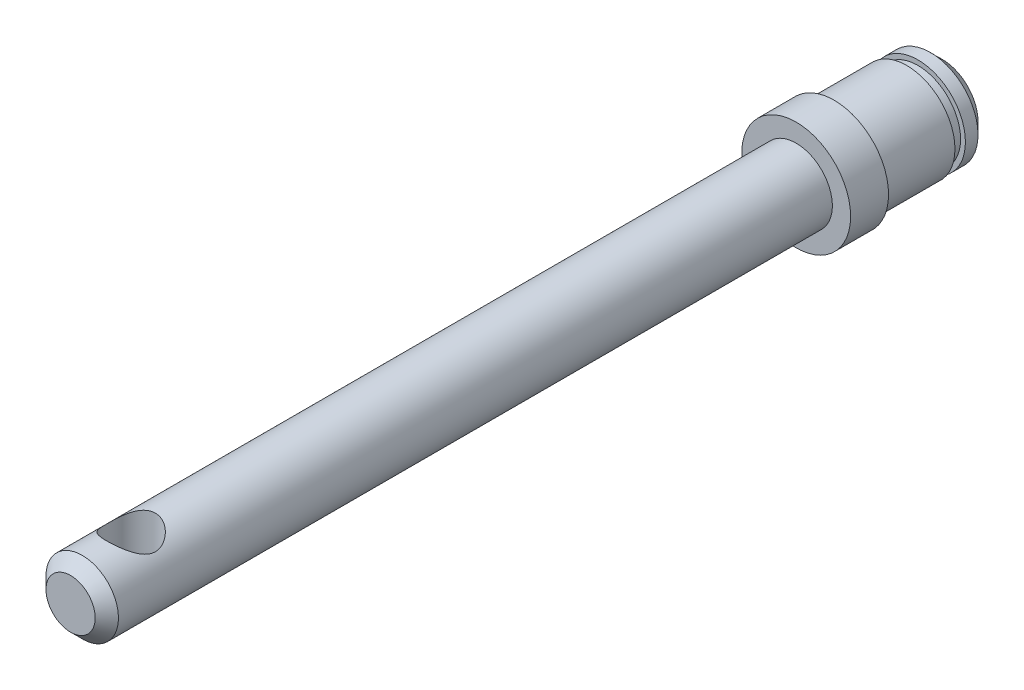
ISO-10303-21;
HEADER;
FILE_DESCRIPTION(('STEP AP214'),'2;1');
FILE_NAME('part.step','',(''),(''),'','','');
FILE_SCHEMA(('AUTOMOTIVE_DESIGN { 1 0 10303 214 1 1 1 1 }'));
ENDSEC;
DATA;
#1=APPLICATION_CONTEXT('core data for automotive mechanical design processes');
#2=APPLICATION_PROTOCOL_DEFINITION('international standard','automotive_design',2000,#1);
#3=PRODUCT_CONTEXT('',#1,'mechanical');
#4=PRODUCT('Part','Part','',(#3));
#5=PRODUCT_RELATED_PRODUCT_CATEGORY('part','',(#4));
#6=PRODUCT_DEFINITION_FORMATION('','',#4);
#7=PRODUCT_DEFINITION_CONTEXT('part definition',#1,'design');
#8=PRODUCT_DEFINITION('design','',#6,#7);
#9=PRODUCT_DEFINITION_SHAPE('','',#8);
#10=(LENGTH_UNIT() NAMED_UNIT(*) SI_UNIT(.MILLI.,.METRE.));
#11=(NAMED_UNIT(*) PLANE_ANGLE_UNIT() SI_UNIT($,.RADIAN.));
#12=(NAMED_UNIT(*) SI_UNIT($,.STERADIAN.) SOLID_ANGLE_UNIT());
#13=UNCERTAINTY_MEASURE_WITH_UNIT(LENGTH_MEASURE(1.E-05),#10,'distance_accuracy_value','');
#14=(GEOMETRIC_REPRESENTATION_CONTEXT(3) GLOBAL_UNCERTAINTY_ASSIGNED_CONTEXT((#13)) GLOBAL_UNIT_ASSIGNED_CONTEXT((#10,
#11,#12)) REPRESENTATION_CONTEXT('',''));
#15=CARTESIAN_POINT('',(0.,0.,0.));
#16=DIRECTION('',(0.,0.,1.));
#17=DIRECTION('',(1.,0.,0.));
#18=AXIS2_PLACEMENT_3D('',#15,#16,#17);
#19=CARTESIAN_POINT('',(0.,0.,-9.5758));
#20=DIRECTION('',(0.,0.,-1.));
#21=DIRECTION('',(-1.,0.,0.));
#22=AXIS2_PLACEMENT_3D('',#19,#20,#21);
#23=PLANE('',#22);
#24=CARTESIAN_POINT('',(0.,0.,-9.57579999993641));
#25=DIRECTION('',(0.,0.,1.));
#26=DIRECTION('',(1.,0.,0.));
#27=AXIS2_PLACEMENT_3D('',#24,#25,#26);
#28=CIRCLE('',#27,2.3494999999798);
#29=CARTESIAN_POINT('',(2.3494999999798,0.,-9.57579999993641));
#30=VERTEX_POINT('',#29);
#31=EDGE_CURVE('E19',#30,#30,#28,.T.);
#32=ORIENTED_EDGE('',*,*,#31,.F.);
#33=EDGE_LOOP('',(#32));
#34=FACE_BOUND('',#33,.T.);
#35=ADVANCED_FACE('F16',(#34),#23,.T.);
#36=CARTESIAN_POINT('',(0.,0.,-8.81380000009813));
#37=DIRECTION('',(0.,0.,1.));
#38=DIRECTION('',(1.,0.,0.));
#39=AXIS2_PLACEMENT_3D('',#36,#37,#38);
#40=CONICAL_SURFACE('',#39,3.11149999987492,0.785398163434747);
#41=ORIENTED_EDGE('',*,*,#31,.T.);
#42=EDGE_LOOP('',(#41));
#43=FACE_BOUND('',#42,.T.);
#44=CARTESIAN_POINT('',(0.,0.,-8.8138));
#45=DIRECTION('',(0.,0.,1.));
#46=DIRECTION('',(1.,0.,0.));
#47=AXIS2_PLACEMENT_3D('',#44,#45,#46);
#48=CIRCLE('',#47,3.1115);
#49=CARTESIAN_POINT('',(3.1115,0.,-8.8138));
#50=VERTEX_POINT('',#49);
#51=EDGE_CURVE('E35',#50,#50,#48,.T.);
#52=ORIENTED_EDGE('',*,*,#51,.F.);
#53=EDGE_LOOP('',(#52));
#54=FACE_BOUND('',#53,.T.);
#55=ADVANCED_FACE('F81',(#43,#54),#40,.T.);
#56=CARTESIAN_POINT('',(0.,0.,-9.5758));
#57=DIRECTION('',(0.,0.,1.));
#58=DIRECTION('',(1.,0.,0.));
#59=AXIS2_PLACEMENT_3D('',#56,#57,#58);
#60=CYLINDRICAL_SURFACE('',#59,3.1115);
#61=ORIENTED_EDGE('',*,*,#51,.T.);
#62=EDGE_LOOP('',(#61));
#63=FACE_BOUND('',#62,.T.);
#64=CARTESIAN_POINT('',(0.,0.,-7.9883));
#65=DIRECTION('',(0.,0.,1.));
#66=DIRECTION('',(1.,0.,0.));
#67=AXIS2_PLACEMENT_3D('',#64,#65,#66);
#68=CIRCLE('',#67,3.1115);
#69=CARTESIAN_POINT('',(3.1115,0.,-7.9883));
#70=VERTEX_POINT('',#69);
#71=EDGE_CURVE('E71',#70,#70,#68,.F.);
#72=ORIENTED_EDGE('',*,*,#71,.T.);
#73=EDGE_LOOP('',(#72));
#74=FACE_BOUND('',#73,.T.);
#75=ADVANCED_FACE('F88',(#63,#74),#60,.T.);
#76=CARTESIAN_POINT('',(0.,0.,-7.9883));
#77=DIRECTION('',(0.,0.,-1.));
#78=DIRECTION('',(-1.,0.,0.));
#79=AXIS2_PLACEMENT_3D('',#76,#77,#78);
#80=PLANE('',#79);
#81=CARTESIAN_POINT('',(0.,0.,-7.9883));
#82=DIRECTION('',(0.,0.,1.));
#83=DIRECTION('',(1.,0.,0.));
#84=AXIS2_PLACEMENT_3D('',#81,#82,#83);
#85=CIRCLE('',#84,2.794);
#86=CARTESIAN_POINT('',(2.794,0.,-7.9883));
#87=VERTEX_POINT('',#86);
#88=EDGE_CURVE('E69',#87,#87,#85,.T.);
#89=ORIENTED_EDGE('',*,*,#88,.F.);
#90=EDGE_LOOP('',(#89));
#91=FACE_BOUND('',#90,.T.);
#92=ORIENTED_EDGE('',*,*,#71,.F.);
#93=EDGE_LOOP('',(#92));
#94=FACE_BOUND('',#93,.T.);
#95=ADVANCED_FACE('F92',(#91,#94),#80,.F.);
#96=CARTESIAN_POINT('',(0.,0.,-7.9883));
#97=DIRECTION('',(0.,0.,1.));
#98=DIRECTION('',(1.,0.,0.));
#99=AXIS2_PLACEMENT_3D('',#96,#97,#98);
#100=CYLINDRICAL_SURFACE('',#99,2.794);
#101=CARTESIAN_POINT('',(0.,0.,-7.2517));
#102=DIRECTION('',(0.,0.,1.));
#103=DIRECTION('',(1.,0.,0.));
#104=AXIS2_PLACEMENT_3D('',#101,#102,#103);
#105=CIRCLE('',#104,2.794);
#106=CARTESIAN_POINT('',(2.794,0.,-7.2517));
#107=VERTEX_POINT('',#106);
#108=EDGE_CURVE('E66',#107,#107,#105,.T.);
#109=ORIENTED_EDGE('',*,*,#108,.F.);
#110=EDGE_LOOP('',(#109));
#111=FACE_BOUND('',#110,.T.);
#112=ORIENTED_EDGE('',*,*,#88,.T.);
#113=EDGE_LOOP('',(#112));
#114=FACE_BOUND('',#113,.T.);
#115=ADVANCED_FACE('F97',(#111,#114),#100,.T.);
#116=CARTESIAN_POINT('',(0.,0.,-7.2517));
#117=DIRECTION('',(0.,0.,-1.));
#118=DIRECTION('',(-1.,0.,0.));
#119=AXIS2_PLACEMENT_3D('',#116,#117,#118);
#120=PLANE('',#119);
#121=ORIENTED_EDGE('',*,*,#108,.T.);
#122=EDGE_LOOP('',(#121));
#123=FACE_BOUND('',#122,.T.);
#124=CARTESIAN_POINT('',(0.,0.,-7.2517));
#125=DIRECTION('',(0.,0.,1.));
#126=DIRECTION('',(1.,0.,0.));
#127=AXIS2_PLACEMENT_3D('',#124,#125,#126);
#128=CIRCLE('',#127,3.1623);
#129=CARTESIAN_POINT('',(3.1623,0.,-7.2517));
#130=VERTEX_POINT('',#129);
#131=EDGE_CURVE('E63',#130,#130,#128,.T.);
#132=ORIENTED_EDGE('',*,*,#131,.F.);
#133=EDGE_LOOP('',(#132));
#134=FACE_BOUND('',#133,.T.);
#135=ADVANCED_FACE('F101',(#123,#134),#120,.T.);
#136=CARTESIAN_POINT('',(0.,0.,-7.2517));
#137=DIRECTION('',(0.,0.,1.));
#138=DIRECTION('',(1.,0.,0.));
#139=AXIS2_PLACEMENT_3D('',#136,#137,#138);
#140=CYLINDRICAL_SURFACE('',#139,3.1623);
#141=ORIENTED_EDGE('',*,*,#131,.T.);
#142=EDGE_LOOP('',(#141));
#143=FACE_BOUND('',#142,.T.);
#144=CARTESIAN_POINT('',(0.,0.,-2.4892));
#145=DIRECTION('',(0.,0.,1.));
#146=DIRECTION('',(1.,0.,0.));
#147=AXIS2_PLACEMENT_3D('',#144,#145,#146);
#148=CIRCLE('',#147,3.1623);
#149=CARTESIAN_POINT('',(3.1623,0.,-2.4892));
#150=VERTEX_POINT('',#149);
#151=EDGE_CURVE('E60',#150,#150,#148,.F.);
#152=ORIENTED_EDGE('',*,*,#151,.T.);
#153=EDGE_LOOP('',(#152));
#154=FACE_BOUND('',#153,.T.);
#155=ADVANCED_FACE('F105',(#143,#154),#140,.T.);
#156=CARTESIAN_POINT('',(0.,0.,-2.4892));
#157=DIRECTION('',(0.,0.,1.));
#158=DIRECTION('',(1.,0.,0.));
#159=AXIS2_PLACEMENT_3D('',#156,#157,#158);
#160=PLANE('',#159);
#161=ORIENTED_EDGE('',*,*,#151,.F.);
#162=EDGE_LOOP('',(#161));
#163=FACE_BOUND('',#162,.T.);
#164=CARTESIAN_POINT('',(0.,0.,-2.4892));
#165=DIRECTION('',(0.,0.,1.));
#166=DIRECTION('',(1.,0.,0.));
#167=AXIS2_PLACEMENT_3D('',#164,#165,#166);
#168=CIRCLE('',#167,3.571875);
#169=CARTESIAN_POINT('',(3.571875,0.,-2.4892));
#170=VERTEX_POINT('',#169);
#171=EDGE_CURVE('E57',#170,#170,#168,.T.);
#172=ORIENTED_EDGE('',*,*,#171,.F.);
#173=EDGE_LOOP('',(#172));
#174=FACE_BOUND('',#173,.T.);
#175=ADVANCED_FACE('F109',(#163,#174),#160,.F.);
#176=CARTESIAN_POINT('',(0.,0.,47.5742));
#177=DIRECTION('',(0.,0.,1.));
#178=DIRECTION('',(1.,0.,0.));
#179=AXIS2_PLACEMENT_3D('',#176,#177,#178);
#180=PLANE('',#179);
#181=CARTESIAN_POINT('',(0.,0.,47.5741999999855));
#182=DIRECTION('',(0.,0.,-1.));
#183=DIRECTION('',(-1.,0.,0.));
#184=AXIS2_PLACEMENT_3D('',#181,#182,#183);
#185=CIRCLE('',#184,1.61289999999781);
#186=CARTESIAN_POINT('',(-1.61289999999781,0.,47.5741999999855));
#187=VERTEX_POINT('',#186);
#188=EDGE_CURVE('E54',#187,#187,#185,.T.);
#189=ORIENTED_EDGE('',*,*,#188,.F.);
#190=EDGE_LOOP('',(#189));
#191=FACE_BOUND('',#190,.T.);
#192=ADVANCED_FACE('F113',(#191),#180,.T.);
#193=CARTESIAN_POINT('',(0.,0.,-2.4892));
#194=DIRECTION('',(0.,0.,1.));
#195=DIRECTION('',(1.,0.,0.));
#196=AXIS2_PLACEMENT_3D('',#193,#194,#195);
#197=CYLINDRICAL_SURFACE('',#196,3.571875);
#198=ORIENTED_EDGE('',*,*,#171,.T.);
#199=EDGE_LOOP('',(#198));
#200=FACE_BOUND('',#199,.T.);
#201=CARTESIAN_POINT('',(0.,0.,0.));
#202=DIRECTION('',(0.,0.,1.));
#203=DIRECTION('',(1.,0.,0.));
#204=AXIS2_PLACEMENT_3D('',#201,#202,#203);
#205=CIRCLE('',#204,3.571875);
#206=CARTESIAN_POINT('',(3.571875,0.,0.));
#207=VERTEX_POINT('',#206);
#208=EDGE_CURVE('E51',#207,#207,#205,.T.);
#209=ORIENTED_EDGE('',*,*,#208,.F.);
#210=EDGE_LOOP('',(#209));
#211=FACE_BOUND('',#210,.T.);
#212=ADVANCED_FACE('F117',(#200,#211),#197,.T.);
#213=CARTESIAN_POINT('',(0.,0.,46.8121999999767));
#214=DIRECTION('',(0.,0.,-1.));
#215=DIRECTION('',(-1.,0.,0.));
#216=AXIS2_PLACEMENT_3D('',#213,#214,#215);
#217=CONICAL_SURFACE('',#216,2.37490000000662,0.785398163397448);
#218=ORIENTED_EDGE('',*,*,#188,.T.);
#219=EDGE_LOOP('',(#218));
#220=FACE_BOUND('',#219,.T.);
#221=CARTESIAN_POINT('',(0.,0.,46.8122));
#222=DIRECTION('',(0.,0.,-1.));
#223=DIRECTION('',(-1.,0.,0.));
#224=AXIS2_PLACEMENT_3D('',#221,#222,#223);
#225=CIRCLE('',#224,2.3749);
#226=CARTESIAN_POINT('',(-2.3749,0.,46.8122));
#227=VERTEX_POINT('',#226);
#228=EDGE_CURVE('E28',#227,#227,#225,.T.);
#229=ORIENTED_EDGE('',*,*,#228,.F.);
#230=EDGE_LOOP('',(#229));
#231=FACE_BOUND('',#230,.T.);
#232=ADVANCED_FACE('F121',(#220,#231),#217,.T.);
#233=CARTESIAN_POINT('',(0.,0.,0.));
#234=DIRECTION('',(0.,0.,1.));
#235=DIRECTION('',(1.,0.,0.));
#236=AXIS2_PLACEMENT_3D('',#233,#234,#235);
#237=PLANE('',#236);
#238=CARTESIAN_POINT('',(0.,0.,0.));
#239=DIRECTION('',(0.,0.,-1.));
#240=DIRECTION('',(-1.,0.,0.));
#241=AXIS2_PLACEMENT_3D('',#238,#239,#240);
#242=CIRCLE('',#241,2.3749);
#243=CARTESIAN_POINT('',(-2.3749,0.,0.));
#244=VERTEX_POINT('',#243);
#245=EDGE_CURVE('E23',#244,#244,#242,.F.);
#246=ORIENTED_EDGE('',*,*,#245,.F.);
#247=EDGE_LOOP('',(#246));
#248=FACE_BOUND('',#247,.T.);
#249=ORIENTED_EDGE('',*,*,#208,.T.);
#250=EDGE_LOOP('',(#249));
#251=FACE_BOUND('',#250,.T.);
#252=ADVANCED_FACE('F124',(#248,#251),#237,.T.);
#253=CARTESIAN_POINT('',(0.,-3.571875,43.60545));
#254=DIRECTION('',(0.,1.,0.));
#255=DIRECTION('',(0.,0.,1.));
#256=AXIS2_PLACEMENT_3D('',#253,#254,#255);
#257=CYLINDRICAL_SURFACE('',#256,1.5875);
#258=CARTESIAN_POINT('',(0.,2.3749,45.19295));
#259=CARTESIAN_POINT('',(-0.0796285021727966,2.37489427166207,45.1929439134093));
#260=CARTESIAN_POINT('',(-0.159333187346092,2.3708547437601,45.1869178453679));
#261=CARTESIAN_POINT('',(-0.316246788253907,2.35507625489168,45.1631617849446));
#262=CARTESIAN_POINT('',(-0.393451638249593,2.34332535323937,45.1454136412255));
#263=CARTESIAN_POINT('',(-0.542790518515763,2.31328830758023,45.0993083312295));
#264=CARTESIAN_POINT('',(-0.614948378456795,2.29503576257873,45.0710056736267));
#265=CARTESIAN_POINT('',(-0.753178545236462,2.25346165524091,45.0050040485006));
#266=CARTESIAN_POINT('',(-0.819251194999285,2.23014037879558,44.9673056109087));
#267=CARTESIAN_POINT('',(-0.949807131451189,2.17792784028168,44.8800881288627));
#268=CARTESIAN_POINT('',(-1.01367601133952,2.14873138397025,44.8298358883516));
#269=CARTESIAN_POINT('',(-1.13266066753279,2.0884656766868,44.7206931180195));
#270=CARTESIAN_POINT('',(-1.18776336726205,2.05739372150985,44.6617899306125));
#271=CARTESIAN_POINT('',(-1.29659427145063,1.99089626995362,44.5261680967343));
#272=CARTESIAN_POINT('',(-1.34871636553572,1.95556248733199,44.4481056626616));
#273=CARTESIAN_POINT('',(-1.43904349853149,1.89008374794265,44.2823403381314));
#274=CARTESIAN_POINT('',(-1.4772725865024,1.85992987284409,44.1946544520516));
#275=CARTESIAN_POINT('',(-1.52904517834333,1.81740283377534,44.0377472795276));
#276=CARTESIAN_POINT('',(-1.54653236351236,1.80240921282223,43.9705447171603));
#277=CARTESIAN_POINT('',(-1.57261168441343,1.77970474695812,43.8332848433952));
#278=CARTESIAN_POINT('',(-1.58121930044462,1.7719812296935,43.763232722255));
#279=CARTESIAN_POINT('',(-1.58899802612375,1.76501215254764,43.6218716388384));
#280=CARTESIAN_POINT('',(-1.58812985724121,1.76580188116326,43.5505586693621));
#281=CARTESIAN_POINT('',(-1.57692650593038,1.77581049841768,43.4092572197684));
#282=CARTESIAN_POINT('',(-1.56658327442516,1.7850365537139,43.3392699174096));
#283=CARTESIAN_POINT('',(-1.53778680769931,1.80988877384798,43.2056567626746));
#284=CARTESIAN_POINT('',(-1.51972103829905,1.82520699487101,43.1418863605764));
#285=CARTESIAN_POINT('',(-1.47635800673587,1.86045582345457,43.0182351850859));
#286=CARTESIAN_POINT('',(-1.45105836975688,1.88038794530891,42.9583556969829));
#287=CARTESIAN_POINT('',(-1.38804369169894,1.92751840139636,42.8311724358925));
#288=CARTESIAN_POINT('',(-1.34884877883874,1.95536954816995,42.7648460457442));
#289=CARTESIAN_POINT('',(-1.26169992826936,2.01270750683002,42.6389401049234));
#290=CARTESIAN_POINT('',(-1.21373539144903,2.04219626760565,42.5793688613398));
#291=CARTESIAN_POINT('',(-1.09822042057742,2.10697571698643,42.4553504562286));
#292=CARTESIAN_POINT('',(-1.02867941502371,2.14213147691545,42.3926663982129));
#293=CARTESIAN_POINT('',(-0.87829590652397,2.20804612806214,42.2797162875604));
#294=CARTESIAN_POINT('',(-0.797461070213304,2.23880797360637,42.2294418743602));
#295=CARTESIAN_POINT('',(-0.642794196366182,2.28740091649053,42.151857840345));
#296=CARTESIAN_POINT('',(-0.570673934887535,2.30658392602361,42.1219812810788));
#297=CARTESIAN_POINT('',(-0.421590346714549,2.33841465201831,42.0729550712348));
#298=CARTESIAN_POINT('',(-0.344638477425361,2.35107721947041,42.05378103609));
#299=CARTESIAN_POINT('',(-0.222529004084351,2.36486476954346,42.0329936390966));
#300=CARTESIAN_POINT('',(-0.178308116016056,2.36861511899109,42.0273651451537));
#301=CARTESIAN_POINT('',(-0.0893995612791168,2.37363462559172,42.0198411908061));
#302=CARTESIAN_POINT('',(-0.0447117904210668,2.37490321648955,42.0179465823498));
#303=CARTESIAN_POINT('',(0.0796285021727959,2.37489427166207,42.0179560865907));
#304=CARTESIAN_POINT('',(0.159333187346092,2.3708547437601,42.0239821546321));
#305=CARTESIAN_POINT('',(0.316246788253906,2.35507625489168,42.0477382150553));
#306=CARTESIAN_POINT('',(0.393451638249593,2.34332535323937,42.0654863587745));
#307=CARTESIAN_POINT('',(0.542790518515763,2.31328830758023,42.1115916687705));
#308=CARTESIAN_POINT('',(0.614948378456795,2.29503576257873,42.1398943263733));
#309=CARTESIAN_POINT('',(0.753178545236463,2.25346165524091,42.2058959514994));
#310=CARTESIAN_POINT('',(0.819251194999285,2.23014037879558,42.2435943890913));
#311=CARTESIAN_POINT('',(0.949807131451189,2.17792784028168,42.3308118711373));
#312=CARTESIAN_POINT('',(1.01367601133952,2.14873138397025,42.3810641116484));
#313=CARTESIAN_POINT('',(1.13266066753279,2.0884656766868,42.4902068819805));
#314=CARTESIAN_POINT('',(1.18776336726205,2.05739372150985,42.5491100693874));
#315=CARTESIAN_POINT('',(1.29659427145063,1.99089626995362,42.6847319032657));
#316=CARTESIAN_POINT('',(1.34871636553572,1.95556248733199,42.7627943373384));
#317=CARTESIAN_POINT('',(1.43904349853149,1.89008374794265,42.9285596618686));
#318=CARTESIAN_POINT('',(1.4772725865024,1.85992987284409,43.0162455479484));
#319=CARTESIAN_POINT('',(1.52904517834333,1.81740283377534,43.1731527204724));
#320=CARTESIAN_POINT('',(1.54653236351236,1.80240921282223,43.2403552828397));
#321=CARTESIAN_POINT('',(1.57261168441343,1.77970474695812,43.3776151566048));
#322=CARTESIAN_POINT('',(1.58121930044462,1.7719812296935,43.447667277745));
#323=CARTESIAN_POINT('',(1.58899802612375,1.76501215254764,43.5890283611616));
#324=CARTESIAN_POINT('',(1.58812985724121,1.76580188116326,43.6603413306379));
#325=CARTESIAN_POINT('',(1.57692650593038,1.77581049841768,43.8016427802316));
#326=CARTESIAN_POINT('',(1.56658327442517,1.7850365537139,43.8716300825904));
#327=CARTESIAN_POINT('',(1.53778680769931,1.80988877384798,44.0052432373254));
#328=CARTESIAN_POINT('',(1.51972103829905,1.825206994871,44.0690136394236));
#329=CARTESIAN_POINT('',(1.47635800673587,1.86045582345457,44.192664814914));
#330=CARTESIAN_POINT('',(1.45105836975689,1.88038794530891,44.2525443030171));
#331=CARTESIAN_POINT('',(1.38804369169894,1.92751840139636,44.3797275641075));
#332=CARTESIAN_POINT('',(1.34884877883874,1.95536954816995,44.4460539542558));
#333=CARTESIAN_POINT('',(1.26169992826936,2.01270750683002,44.5719598950766));
#334=CARTESIAN_POINT('',(1.21373539144903,2.04219626760564,44.6315311386602));
#335=CARTESIAN_POINT('',(1.09822042057742,2.10697571698643,44.7555495437714));
#336=CARTESIAN_POINT('',(1.02867941502371,2.14213147691544,44.8182336017871));
#337=CARTESIAN_POINT('',(0.87829590652398,2.20804612806214,44.9311837124396));
#338=CARTESIAN_POINT('',(0.797461070213316,2.23880797360636,44.9814581256398));
#339=CARTESIAN_POINT('',(0.642794196366197,2.28740091649053,45.059042159655));
#340=CARTESIAN_POINT('',(0.57067393488755,2.30658392602361,45.0889187189212));
#341=CARTESIAN_POINT('',(0.421590346714565,2.33841465201831,45.1379449287651));
#342=CARTESIAN_POINT('',(0.344638477425378,2.3510772194704,45.15711896391));
#343=CARTESIAN_POINT('',(0.222529004084365,2.36486476954346,45.1779063609034));
#344=CARTESIAN_POINT('',(0.178308116016067,2.36861511899109,45.1835348548463));
#345=CARTESIAN_POINT('',(0.0893995612791212,2.37363462559172,45.1910588091939));
#346=CARTESIAN_POINT('',(0.0447117904210687,2.37490321648955,45.1929534176502));
#347=CARTESIAN_POINT('',(0.,2.3749,45.19295));
#348=B_SPLINE_CURVE_WITH_KNOTS('',3,(#258,#259,#260,#261,#262,#263,#264,#265,#266,#267,#268,
#269,#270,#271,#272,#273,#274,#275,#276,#277,#278,#279,#280,#281,#282,#283,#284,#285,#286,#287,
#288,#289,#290,#291,#292,#293,#294,#295,#296,#297,#298,#299,#300,#301,#302,#303,#304,#305,#306,
#307,#308,#309,#310,#311,#312,#313,#314,#315,#316,#317,#318,#319,#320,#321,#322,#323,#324,#325,
#326,#327,#328,#329,#330,#331,#332,#333,#334,#335,#336,#337,#338,#339,#340,#341,#342,#343,#344,
#345,#346,#347),.UNSPECIFIED.,.T.,.F.,(4,2,2,2,2,2,2,2,2,2,2,2,2,2,2,2,2,2,2,2,2,2,2,2,2,2,2,2,
2,2,2,2,2,2,2,2,2,2,2,2,2,2,2,2,4),(0.,0.238700395852421,0.477771282535445,0.71562421428543,
0.95346373392742,1.21155549797826,1.47002872073382,1.76952408912618,2.06849852769238,
2.28077891750231,2.49268859719911,2.70547700634111,2.9184463472867,3.12179507761272,
3.32521064236503,3.57012288877609,3.815333120713,4.1139409115089,4.41234697329097,
4.65252034508975,4.89214425005817,5.02614510978654,5.16017654051243,5.39887693636485,
5.63794782304788,5.87580075479786,6.11364027443985,6.37173203849069,6.63020526124625,
6.92970062963861,7.22867506820481,7.44095545801474,7.65286513771153,7.86565354685354,
8.07862288779913,8.28197161812515,8.48538718287745,8.73029942928851,8.97550966122542,
9.27411745202132,9.57252351380338,9.81269688560216,10.0523207905706,10.186321650299,
10.3203530810249),.UNSPECIFIED.);
#349=CARTESIAN_POINT('',(0.,2.3749,45.19295));
#350=VERTEX_POINT('',#349);
#351=EDGE_CURVE('E46',#350,#350,#348,.T.);
#352=ORIENTED_EDGE('',*,*,#351,.F.);
#353=EDGE_LOOP('',(#352));
#354=FACE_BOUND('',#353,.T.);
#355=CARTESIAN_POINT('',(0.,-2.3749,45.19295));
#356=CARTESIAN_POINT('',(0.079628502172797,-2.37489427166208,45.1929439134093));
#357=CARTESIAN_POINT('',(0.159333187346093,-2.3708547437601,45.1869178453679));
#358=CARTESIAN_POINT('',(0.316246788253907,-2.35507625489168,45.1631617849446));
#359=CARTESIAN_POINT('',(0.393451638249594,-2.34332535323937,45.1454136412255));
#360=CARTESIAN_POINT('',(0.542790518515763,-2.31328830758023,45.0993083312295));
#361=CARTESIAN_POINT('',(0.614948378456796,-2.29503576257873,45.0710056736267));
#362=CARTESIAN_POINT('',(0.753178545236462,-2.25346165524091,45.0050040485006));
#363=CARTESIAN_POINT('',(0.819251194999285,-2.23014037879558,44.9673056109087));
#364=CARTESIAN_POINT('',(0.949807131451189,-2.17792784028168,44.8800881288627));
#365=CARTESIAN_POINT('',(1.01367601133952,-2.14873138397025,44.8298358883516));
#366=CARTESIAN_POINT('',(1.13266066753279,-2.0884656766868,44.7206931180195));
#367=CARTESIAN_POINT('',(1.18776336726205,-2.05739372150985,44.6617899306125));
#368=CARTESIAN_POINT('',(1.29659427145063,-1.99089626995362,44.5261680967343));
#369=CARTESIAN_POINT('',(1.34871636553572,-1.95556248733199,44.4481056626616));
#370=CARTESIAN_POINT('',(1.43904349853149,-1.89008374794265,44.2823403381314));
#371=CARTESIAN_POINT('',(1.4772725865024,-1.85992987284409,44.1946544520516));
#372=CARTESIAN_POINT('',(1.52904517834333,-1.81740283377534,44.0377472795276));
#373=CARTESIAN_POINT('',(1.54653236351237,-1.80240921282223,43.9705447171602));
#374=CARTESIAN_POINT('',(1.57261168441344,-1.77970474695812,43.8332848433952));
#375=CARTESIAN_POINT('',(1.58121930044462,-1.7719812296935,43.763232722255));
#376=CARTESIAN_POINT('',(1.58899802612375,-1.76501215254764,43.6218716388384));
#377=CARTESIAN_POINT('',(1.58812985724121,-1.76580188116326,43.5505586693621));
#378=CARTESIAN_POINT('',(1.57692650593038,-1.77581049841768,43.4092572197684));
#379=CARTESIAN_POINT('',(1.56658327442516,-1.7850365537139,43.3392699174096));
#380=CARTESIAN_POINT('',(1.53778680769931,-1.80988877384798,43.2056567626746));
#381=CARTESIAN_POINT('',(1.51972103829905,-1.82520699487101,43.1418863605764));
#382=CARTESIAN_POINT('',(1.47635800673587,-1.86045582345457,43.0182351850859));
#383=CARTESIAN_POINT('',(1.45105836975688,-1.88038794530891,42.9583556969829));
#384=CARTESIAN_POINT('',(1.38804369169894,-1.92751840139636,42.8311724358925));
#385=CARTESIAN_POINT('',(1.34884877883874,-1.95536954816995,42.7648460457442));
#386=CARTESIAN_POINT('',(1.26169992826936,-2.01270750683002,42.6389401049234));
#387=CARTESIAN_POINT('',(1.21373539144903,-2.04219626760565,42.5793688613398));
#388=CARTESIAN_POINT('',(1.09822042057742,-2.10697571698643,42.4553504562286));
#389=CARTESIAN_POINT('',(1.0286794150237,-2.14213147691545,42.3926663982129));
#390=CARTESIAN_POINT('',(0.878295906523966,-2.20804612806214,42.2797162875604));
#391=CARTESIAN_POINT('',(0.797461070213302,-2.23880797360637,42.2294418743602));
#392=CARTESIAN_POINT('',(0.642794196366183,-2.28740091649053,42.151857840345));
#393=CARTESIAN_POINT('',(0.570673934887537,-2.30658392602361,42.1219812810788));
#394=CARTESIAN_POINT('',(0.421590346714551,-2.33841465201831,42.0729550712348));
#395=CARTESIAN_POINT('',(0.344638477425362,-2.35107721947041,42.05378103609));
#396=CARTESIAN_POINT('',(0.22252900408435,-2.36486476954346,42.0329936390966));
#397=CARTESIAN_POINT('',(0.178308116016056,-2.36861511899109,42.0273651451537));
#398=CARTESIAN_POINT('',(0.0893995612791169,-2.37363462559172,42.0198411908061));
#399=CARTESIAN_POINT('',(0.0447117904210671,-2.37490321648955,42.0179465823498));
#400=CARTESIAN_POINT('',(-0.0796285021727957,-2.37489427166208,42.0179560865907));
#401=CARTESIAN_POINT('',(-0.159333187346092,-2.3708547437601,42.0239821546321));
#402=CARTESIAN_POINT('',(-0.316246788253906,-2.35507625489168,42.0477382150553));
#403=CARTESIAN_POINT('',(-0.393451638249593,-2.34332535323937,42.0654863587745));
#404=CARTESIAN_POINT('',(-0.542790518515762,-2.31328830758023,42.1115916687705));
#405=CARTESIAN_POINT('',(-0.614948378456795,-2.29503576257873,42.1398943263733));
#406=CARTESIAN_POINT('',(-0.753178545236462,-2.25346165524091,42.2058959514994));
#407=CARTESIAN_POINT('',(-0.819251194999284,-2.23014037879558,42.2435943890913));
#408=CARTESIAN_POINT('',(-0.949807131451189,-2.17792784028168,42.3308118711373));
#409=CARTESIAN_POINT('',(-1.01367601133952,-2.14873138397025,42.3810641116484));
#410=CARTESIAN_POINT('',(-1.13266066753279,-2.0884656766868,42.4902068819805));
#411=CARTESIAN_POINT('',(-1.18776336726205,-2.05739372150985,42.5491100693874));
#412=CARTESIAN_POINT('',(-1.29659427145063,-1.99089626995362,42.6847319032657));
#413=CARTESIAN_POINT('',(-1.34871636553572,-1.95556248733199,42.7627943373384));
#414=CARTESIAN_POINT('',(-1.43904349853149,-1.89008374794265,42.9285596618686));
#415=CARTESIAN_POINT('',(-1.4772725865024,-1.85992987284409,43.0162455479484));
#416=CARTESIAN_POINT('',(-1.52904517834333,-1.81740283377534,43.1731527204724));
#417=CARTESIAN_POINT('',(-1.54653236351237,-1.80240921282223,43.2403552828398));
#418=CARTESIAN_POINT('',(-1.57261168441344,-1.77970474695812,43.3776151566048));
#419=CARTESIAN_POINT('',(-1.58121930044462,-1.7719812296935,43.447667277745));
#420=CARTESIAN_POINT('',(-1.58899802612375,-1.76501215254764,43.5890283611616));
#421=CARTESIAN_POINT('',(-1.58812985724121,-1.76580188116326,43.6603413306379));
#422=CARTESIAN_POINT('',(-1.57692650593038,-1.77581049841768,43.8016427802316));
#423=CARTESIAN_POINT('',(-1.56658327442516,-1.7850365537139,43.8716300825904));
#424=CARTESIAN_POINT('',(-1.53778680769931,-1.80988877384798,44.0052432373254));
#425=CARTESIAN_POINT('',(-1.51972103829905,-1.82520699487101,44.0690136394236));
#426=CARTESIAN_POINT('',(-1.47635800673587,-1.86045582345457,44.192664814914));
#427=CARTESIAN_POINT('',(-1.45105836975688,-1.88038794530891,44.2525443030171));
#428=CARTESIAN_POINT('',(-1.38804369169894,-1.92751840139636,44.3797275641075));
#429=CARTESIAN_POINT('',(-1.34884877883874,-1.95536954816995,44.4460539542558));
#430=CARTESIAN_POINT('',(-1.26169992826936,-2.01270750683002,44.5719598950766));
#431=CARTESIAN_POINT('',(-1.21373539144903,-2.04219626760565,44.6315311386602));
#432=CARTESIAN_POINT('',(-1.09822042057742,-2.10697571698643,44.7555495437714));
#433=CARTESIAN_POINT('',(-1.02867941502371,-2.14213147691544,44.8182336017871));
#434=CARTESIAN_POINT('',(-0.878295906523972,-2.20804612806214,44.9311837124396));
#435=CARTESIAN_POINT('',(-0.797461070213305,-2.23880797360637,44.9814581256398));
#436=CARTESIAN_POINT('',(-0.642794196366183,-2.28740091649053,45.059042159655));
#437=CARTESIAN_POINT('',(-0.570673934887537,-2.30658392602361,45.0889187189212));
#438=CARTESIAN_POINT('',(-0.421590346714551,-2.33841465201831,45.1379449287651));
#439=CARTESIAN_POINT('',(-0.344638477425362,-2.35107721947041,45.15711896391));
#440=CARTESIAN_POINT('',(-0.22252900408435,-2.36486476954346,45.1779063609034));
#441=CARTESIAN_POINT('',(-0.178308116016055,-2.36861511899109,45.1835348548463));
#442=CARTESIAN_POINT('',(-0.0893995612791154,-2.37363462559172,45.1910588091939));
#443=CARTESIAN_POINT('',(-0.0447117904210655,-2.37490321648955,45.1929534176502));
#444=CARTESIAN_POINT('',(0.,-2.3749,45.19295));
#445=B_SPLINE_CURVE_WITH_KNOTS('',3,(#355,#356,#357,#358,#359,#360,#361,#362,#363,#364,#365,
#366,#367,#368,#369,#370,#371,#372,#373,#374,#375,#376,#377,#378,#379,#380,#381,#382,#383,#384,
#385,#386,#387,#388,#389,#390,#391,#392,#393,#394,#395,#396,#397,#398,#399,#400,#401,#402,#403,
#404,#405,#406,#407,#408,#409,#410,#411,#412,#413,#414,#415,#416,#417,#418,#419,#420,#421,#422,
#423,#424,#425,#426,#427,#428,#429,#430,#431,#432,#433,#434,#435,#436,#437,#438,#439,#440,#441,
#442,#443,#444),.UNSPECIFIED.,.T.,.F.,(4,2,2,2,2,2,2,2,2,2,2,2,2,2,2,2,2,2,2,2,2,2,2,2,2,2,2,2,
2,2,2,2,2,2,2,2,2,2,2,2,2,2,2,2,4),(0.,0.238700395852421,0.477771282535445,0.71562421428543,
0.953463733927419,1.21155549797826,1.47002872073382,1.76952408912618,2.06849852769238,
2.28077891750232,2.49268859719911,2.70547700634111,2.9184463472867,3.12179507761272,
3.32521064236503,3.57012288877609,3.815333120713,4.11394091150891,4.41234697329097,
4.65252034508974,4.89214425005817,5.02614510978654,5.16017654051243,5.39887693636485,
5.63794782304788,5.87580075479786,6.11364027443985,6.37173203849069,6.63020526124625,
6.92970062963861,7.22867506820481,7.44095545801475,7.65286513771154,7.86565354685354,
8.07862288779913,8.28197161812515,8.48538718287746,8.73029942928852,8.97550966122543,
9.27411745202133,9.5725235138034,9.81269688560218,10.0523207905706,10.186321650299,
10.3203530810249),.UNSPECIFIED.);
#446=CARTESIAN_POINT('',(0.,-2.3749,45.19295));
#447=VERTEX_POINT('',#446);
#448=EDGE_CURVE('E10',#447,#447,#445,.T.);
#449=ORIENTED_EDGE('',*,*,#448,.F.);
#450=EDGE_LOOP('',(#449));
#451=FACE_BOUND('',#450,.T.);
#452=ADVANCED_FACE('F38',(#354,#451),#257,.F.);
#453=CARTESIAN_POINT('',(0.,0.,47.5742));
#454=DIRECTION('',(0.,0.,-1.));
#455=DIRECTION('',(-1.,0.,0.));
#456=AXIS2_PLACEMENT_3D('',#453,#454,#455);
#457=CYLINDRICAL_SURFACE('',#456,2.3749);
#458=ORIENTED_EDGE('',*,*,#228,.T.);
#459=EDGE_LOOP('',(#458));
#460=FACE_BOUND('',#459,.T.);
#461=ORIENTED_EDGE('',*,*,#448,.T.);
#462=EDGE_LOOP('',(#461));
#463=FACE_BOUND('',#462,.T.);
#464=ORIENTED_EDGE('',*,*,#245,.T.);
#465=EDGE_LOOP('',(#464));
#466=FACE_BOUND('',#465,.T.);
#467=ORIENTED_EDGE('',*,*,#351,.T.);
#468=EDGE_LOOP('',(#467));
#469=FACE_BOUND('',#468,.T.);
#470=ADVANCED_FACE('F41',(#460,#463,#466,#469),#457,.T.);
#471=CLOSED_SHELL('',(#35,#55,#75,#95,#115,#135,#155,#175,#192,#212,#232,#252,#452,#470));
#472=MANIFOLD_SOLID_BREP('B1',#471);
#473=ADVANCED_BREP_SHAPE_REPRESENTATION('',(#18,#472),#14);
#474=SHAPE_DEFINITION_REPRESENTATION(#9,#473);
ENDSEC;
END-ISO-10303-21;
